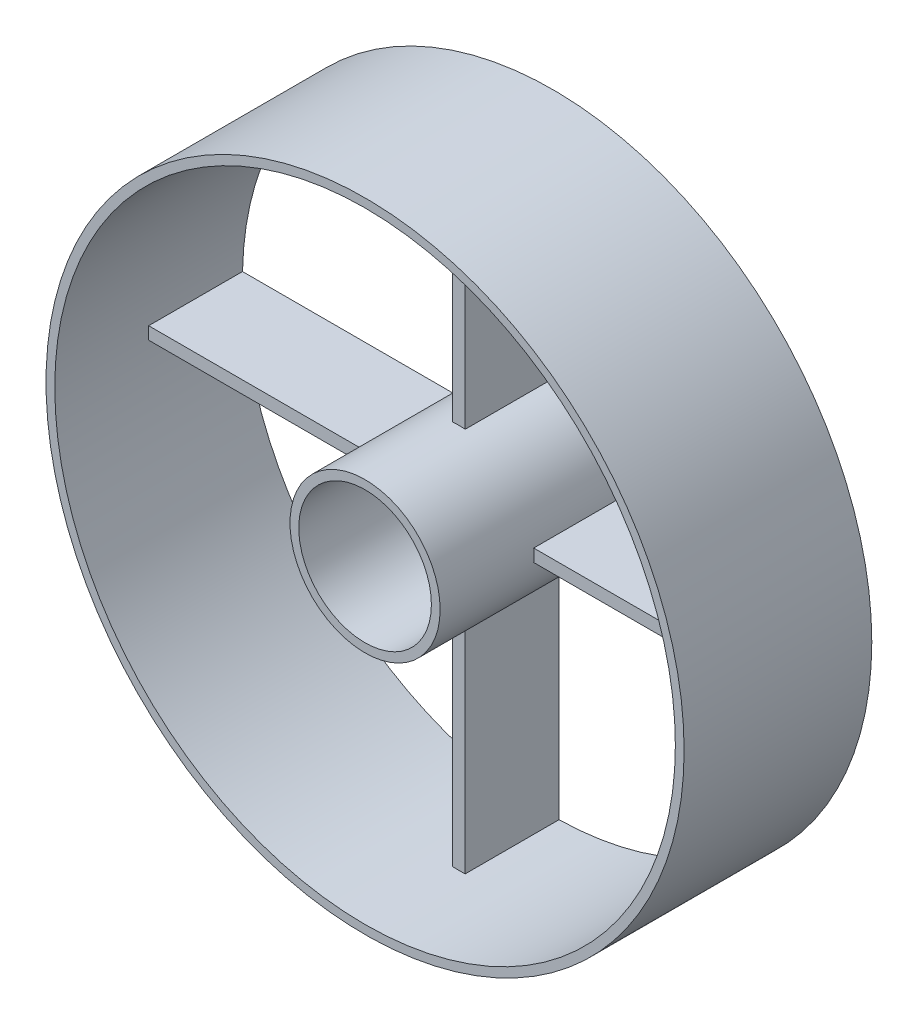
ISO-10303-21;
HEADER;
FILE_DESCRIPTION(('STEP AP214'),'2;1');
FILE_NAME('part.step','',(''),(''),'','','');
FILE_SCHEMA(('AUTOMOTIVE_DESIGN { 1 0 10303 214 1 1 1 1 }'));
ENDSEC;
DATA;
#1=APPLICATION_CONTEXT('core data for automotive mechanical design processes');
#2=APPLICATION_PROTOCOL_DEFINITION('international standard','automotive_design',2000,#1);
#3=PRODUCT_CONTEXT('',#1,'mechanical');
#4=PRODUCT('Part','Part','',(#3));
#5=PRODUCT_RELATED_PRODUCT_CATEGORY('part','',(#4));
#6=PRODUCT_DEFINITION_FORMATION('','',#4);
#7=PRODUCT_DEFINITION_CONTEXT('part definition',#1,'design');
#8=PRODUCT_DEFINITION('design','',#6,#7);
#9=PRODUCT_DEFINITION_SHAPE('','',#8);
#10=(LENGTH_UNIT() NAMED_UNIT(*) SI_UNIT(.MILLI.,.METRE.));
#11=(NAMED_UNIT(*) PLANE_ANGLE_UNIT() SI_UNIT($,.RADIAN.));
#12=(NAMED_UNIT(*) SI_UNIT($,.STERADIAN.) SOLID_ANGLE_UNIT());
#13=UNCERTAINTY_MEASURE_WITH_UNIT(LENGTH_MEASURE(1.E-05),#10,'distance_accuracy_value','');
#14=(GEOMETRIC_REPRESENTATION_CONTEXT(3) GLOBAL_UNCERTAINTY_ASSIGNED_CONTEXT((#13)) GLOBAL_UNIT_ASSIGNED_CONTEXT((#10,
#11,#12)) REPRESENTATION_CONTEXT('',''));
#15=CARTESIAN_POINT('',(0.,0.,0.));
#16=DIRECTION('',(0.,0.,1.));
#17=DIRECTION('',(1.,0.,0.));
#18=AXIS2_PLACEMENT_3D('',#15,#16,#17);
#19=CARTESIAN_POINT('',(0.,0.,-7.5));
#20=DIRECTION('',(0.,0.,1.));
#21=DIRECTION('',(1.,0.,0.));
#22=AXIS2_PLACEMENT_3D('',#19,#20,#21);
#23=CYLINDRICAL_SURFACE('',#22,25.5);
#24=CARTESIAN_POINT('',(0.,0.,-7.5));
#25=DIRECTION('',(0.,0.,1.));
#26=DIRECTION('',(1.,0.,0.));
#27=AXIS2_PLACEMENT_3D('',#24,#25,#26);
#28=CIRCLE('',#27,25.5);
#29=CARTESIAN_POINT('',(25.5,0.,-7.5));
#30=VERTEX_POINT('',#29);
#31=EDGE_CURVE('E12',#30,#30,#28,.T.);
#32=ORIENTED_EDGE('',*,*,#31,.T.);
#33=EDGE_LOOP('',(#32));
#34=FACE_BOUND('',#33,.T.);
#35=CARTESIAN_POINT('',(0.,0.,7.5));
#36=DIRECTION('',(0.,0.,1.));
#37=DIRECTION('',(1.,0.,0.));
#38=AXIS2_PLACEMENT_3D('',#35,#36,#37);
#39=CIRCLE('',#38,25.5);
#40=CARTESIAN_POINT('',(25.5,0.,7.5));
#41=VERTEX_POINT('',#40);
#42=EDGE_CURVE('E245',#41,#41,#39,.T.);
#43=ORIENTED_EDGE('',*,*,#42,.F.);
#44=EDGE_LOOP('',(#43));
#45=FACE_BOUND('',#44,.T.);
#46=ADVANCED_FACE('F102',(#34,#45),#23,.T.);
#47=CARTESIAN_POINT('',(0.,0.,-7.5));
#48=DIRECTION('',(0.,0.,1.));
#49=DIRECTION('',(1.,0.,0.));
#50=AXIS2_PLACEMENT_3D('',#47,#48,#49);
#51=PLANE('',#50);
#52=DIRECTION('',(0.,1.,0.));
#53=VECTOR('',#52,1.);
#54=CARTESIAN_POINT('',(0.500000000000003,-24.7949591651206,-7.5));
#55=LINE('',#54,#53);
#56=CARTESIAN_POINT('',(0.500000000000003,-24.7949591651206,-7.5));
#57=VERTEX_POINT('',#56);
#58=CARTESIAN_POINT('',(0.500000000000002,-5.9791303715507,-7.5));
#59=VERTEX_POINT('',#58);
#60=EDGE_CURVE('E218',#57,#59,#55,.T.);
#61=ORIENTED_EDGE('',*,*,#60,.F.);
#62=CARTESIAN_POINT('',(0.,0.,-7.5));
#63=DIRECTION('',(0.,0.,1.));
#64=DIRECTION('',(1.,0.,0.));
#65=AXIS2_PLACEMENT_3D('',#62,#63,#64);
#66=CIRCLE('',#65,24.8);
#67=CARTESIAN_POINT('',(24.7949591651206,-0.500000000000014,-7.5));
#68=VERTEX_POINT('',#67);
#69=EDGE_CURVE('E232',#57,#68,#66,.T.);
#70=ORIENTED_EDGE('',*,*,#69,.T.);
#71=DIRECTION('',(1.,0.,0.));
#72=VECTOR('',#71,1.);
#73=CARTESIAN_POINT('',(5.9791303715507,-0.5,-7.5));
#74=LINE('',#73,#72);
#75=CARTESIAN_POINT('',(5.9791303715507,-0.5,-7.5));
#76=VERTEX_POINT('',#75);
#77=EDGE_CURVE('E285',#76,#68,#74,.T.);
#78=ORIENTED_EDGE('',*,*,#77,.F.);
#79=CARTESIAN_POINT('',(0.,0.,-7.5));
#80=DIRECTION('',(0.,0.,1.));
#81=DIRECTION('',(1.,0.,0.));
#82=AXIS2_PLACEMENT_3D('',#79,#80,#81);
#83=CIRCLE('',#82,6.);
#84=EDGE_CURVE('E234',#59,#76,#83,.T.);
#85=ORIENTED_EDGE('',*,*,#84,.F.);
#86=EDGE_LOOP('',(#61,#70,#78,#85));
#87=FACE_BOUND('',#86,.T.);
#88=DIRECTION('',(1.,0.,0.));
#89=VECTOR('',#88,1.);
#90=CARTESIAN_POINT('',(-24.7949591651206,-0.5,-7.5));
#91=LINE('',#90,#89);
#92=CARTESIAN_POINT('',(-24.7949591651206,-0.5,-7.5));
#93=VERTEX_POINT('',#92);
#94=CARTESIAN_POINT('',(-5.9791303715507,-0.499999999999999,-7.5));
#95=VERTEX_POINT('',#94);
#96=EDGE_CURVE('E526',#93,#95,#91,.T.);
#97=ORIENTED_EDGE('',*,*,#96,.F.);
#98=CARTESIAN_POINT('',(-0.499999999999997,-24.7949591651206,-7.5));
#99=VERTEX_POINT('',#98);
#100=EDGE_CURVE('E242',#93,#99,#66,.T.);
#101=ORIENTED_EDGE('',*,*,#100,.T.);
#102=DIRECTION('',(0.,-1.,0.));
#103=VECTOR('',#102,1.);
#104=CARTESIAN_POINT('',(-0.499999999999997,-24.7949591651206,-7.5));
#105=LINE('',#104,#103);
#106=CARTESIAN_POINT('',(-0.499999999999997,-5.9791303715507,-7.5));
#107=VERTEX_POINT('',#106);
#108=EDGE_CURVE('E225',#107,#99,#105,.T.);
#109=ORIENTED_EDGE('',*,*,#108,.F.);
#110=EDGE_CURVE('E318',#95,#107,#83,.T.);
#111=ORIENTED_EDGE('',*,*,#110,.F.);
#112=EDGE_LOOP('',(#97,#101,#109,#111));
#113=FACE_BOUND('',#112,.T.);
#114=DIRECTION('',(-1.,0.,0.));
#115=VECTOR('',#114,1.);
#116=CARTESIAN_POINT('',(5.9791303715507,0.5,-7.5));
#117=LINE('',#116,#115);
#118=CARTESIAN_POINT('',(24.7949591651206,0.5,-7.5));
#119=VERTEX_POINT('',#118);
#120=CARTESIAN_POINT('',(5.9791303715507,0.5,-7.5));
#121=VERTEX_POINT('',#120);
#122=EDGE_CURVE('E287',#119,#121,#117,.T.);
#123=ORIENTED_EDGE('',*,*,#122,.F.);
#124=CARTESIAN_POINT('',(0.500000000000003,24.7949591651206,-7.5));
#125=VERTEX_POINT('',#124);
#126=EDGE_CURVE('E243',#119,#125,#66,.T.);
#127=ORIENTED_EDGE('',*,*,#126,.T.);
#128=DIRECTION('',(0.,1.,0.));
#129=VECTOR('',#128,1.);
#130=CARTESIAN_POINT('',(0.500000000000003,24.7949591651206,-7.5));
#131=LINE('',#130,#129);
#132=CARTESIAN_POINT('',(0.500000000000003,5.9791303715507,-7.5));
#133=VERTEX_POINT('',#132);
#134=EDGE_CURVE('E320',#133,#125,#131,.T.);
#135=ORIENTED_EDGE('',*,*,#134,.F.);
#136=EDGE_CURVE('E314',#121,#133,#83,.T.);
#137=ORIENTED_EDGE('',*,*,#136,.F.);
#138=EDGE_LOOP('',(#123,#127,#135,#137));
#139=FACE_BOUND('',#138,.T.);
#140=CARTESIAN_POINT('',(-0.499999999999997,24.7949591651206,-7.5));
#141=VERTEX_POINT('',#140);
#142=CARTESIAN_POINT('',(-24.7949591651206,0.5,-7.5));
#143=VERTEX_POINT('',#142);
#144=EDGE_CURVE('E109',#141,#143,#66,.T.);
#145=ORIENTED_EDGE('',*,*,#144,.T.);
#146=DIRECTION('',(-1.,0.,0.));
#147=VECTOR('',#146,1.);
#148=CARTESIAN_POINT('',(-24.7949591651206,0.5,-7.5));
#149=LINE('',#148,#147);
#150=CARTESIAN_POINT('',(-5.9791303715507,0.5,-7.5));
#151=VERTEX_POINT('',#150);
#152=EDGE_CURVE('E254',#151,#143,#149,.T.);
#153=ORIENTED_EDGE('',*,*,#152,.F.);
#154=CARTESIAN_POINT('',(-0.499999999999997,5.9791303715507,-7.5));
#155=VERTEX_POINT('',#154);
#156=EDGE_CURVE('E315',#155,#151,#83,.T.);
#157=ORIENTED_EDGE('',*,*,#156,.F.);
#158=DIRECTION('',(0.,-1.,0.));
#159=VECTOR('',#158,1.);
#160=CARTESIAN_POINT('',(-0.499999999999997,24.7949591651206,-7.5));
#161=LINE('',#160,#159);
#162=EDGE_CURVE('E256',#141,#155,#161,.T.);
#163=ORIENTED_EDGE('',*,*,#162,.F.);
#164=EDGE_LOOP('',(#145,#153,#157,#163));
#165=FACE_BOUND('',#164,.T.);
#166=ORIENTED_EDGE('',*,*,#31,.F.);
#167=EDGE_LOOP('',(#166));
#168=FACE_BOUND('',#167,.T.);
#169=CARTESIAN_POINT('',(0.,0.,-7.5));
#170=DIRECTION('',(0.,0.,1.));
#171=DIRECTION('',(1.,0.,0.));
#172=AXIS2_PLACEMENT_3D('',#169,#170,#171);
#173=CIRCLE('',#172,5.3);
#174=CARTESIAN_POINT('',(5.3,0.,-7.5));
#175=VERTEX_POINT('',#174);
#176=EDGE_CURVE('E311',#175,#175,#173,.T.);
#177=ORIENTED_EDGE('',*,*,#176,.T.);
#178=EDGE_LOOP('',(#177));
#179=FACE_BOUND('',#178,.T.);
#180=ADVANCED_FACE('F229',(#87,#113,#139,#165,#168,#179),#51,.F.);
#181=CARTESIAN_POINT('',(0.,0.,-7.5));
#182=DIRECTION('',(0.,0.,1.));
#183=DIRECTION('',(1.,0.,0.));
#184=AXIS2_PLACEMENT_3D('',#181,#182,#183);
#185=CYLINDRICAL_SURFACE('',#184,24.8);
#186=CARTESIAN_POINT('',(0.,0.,0.));
#187=DIRECTION('',(0.,0.,1.));
#188=DIRECTION('',(1.,0.,0.));
#189=AXIS2_PLACEMENT_3D('',#186,#187,#188);
#190=CIRCLE('',#189,24.8);
#191=CARTESIAN_POINT('',(-0.499999999999997,-24.7949591651206,0.));
#192=VERTEX_POINT('',#191);
#193=CARTESIAN_POINT('',(0.500000000000003,-24.7949591651206,0.));
#194=VERTEX_POINT('',#193);
#195=EDGE_CURVE('E513',#192,#194,#190,.T.);
#196=ORIENTED_EDGE('',*,*,#195,.F.);
#197=DIRECTION('',(0.,0.,1.));
#198=VECTOR('',#197,1.);
#199=CARTESIAN_POINT('',(-0.499999999999997,-24.7949591651206,-7.5));
#200=LINE('',#199,#198);
#201=EDGE_CURVE('E521',#99,#192,#200,.T.);
#202=ORIENTED_EDGE('',*,*,#201,.F.);
#203=ORIENTED_EDGE('',*,*,#100,.F.);
#204=DIRECTION('',(0.,0.,1.));
#205=VECTOR('',#204,1.);
#206=CARTESIAN_POINT('',(-24.7949591651206,-0.5,-7.5));
#207=LINE('',#206,#205);
#208=CARTESIAN_POINT('',(-24.7949591651206,-0.5,0.));
#209=VERTEX_POINT('',#208);
#210=EDGE_CURVE('E283',#93,#209,#207,.T.);
#211=ORIENTED_EDGE('',*,*,#210,.T.);
#212=CARTESIAN_POINT('',(0.,0.,0.));
#213=DIRECTION('',(0.,0.,1.));
#214=DIRECTION('',(1.,0.,0.));
#215=AXIS2_PLACEMENT_3D('',#212,#213,#214);
#216=CIRCLE('',#215,24.8);
#217=CARTESIAN_POINT('',(-24.7949591651206,0.5,0.));
#218=VERTEX_POINT('',#217);
#219=EDGE_CURVE('E266',#218,#209,#216,.T.);
#220=ORIENTED_EDGE('',*,*,#219,.F.);
#221=DIRECTION('',(0.,0.,1.));
#222=VECTOR('',#221,1.);
#223=CARTESIAN_POINT('',(-24.7949591651206,0.5,-7.5));
#224=LINE('',#223,#222);
#225=EDGE_CURVE('E263',#143,#218,#224,.T.);
#226=ORIENTED_EDGE('',*,*,#225,.F.);
#227=ORIENTED_EDGE('',*,*,#144,.F.);
#228=DIRECTION('',(0.,0.,1.));
#229=VECTOR('',#228,1.);
#230=CARTESIAN_POINT('',(-0.499999999999997,24.7949591651206,-7.5));
#231=LINE('',#230,#229);
#232=CARTESIAN_POINT('',(-0.499999999999997,24.7949591651206,0.));
#233=VERTEX_POINT('',#232);
#234=EDGE_CURVE('E260',#141,#233,#231,.T.);
#235=ORIENTED_EDGE('',*,*,#234,.T.);
#236=CARTESIAN_POINT('',(0.,0.,0.));
#237=DIRECTION('',(0.,0.,1.));
#238=DIRECTION('',(1.,0.,0.));
#239=AXIS2_PLACEMENT_3D('',#236,#237,#238);
#240=CIRCLE('',#239,24.8);
#241=CARTESIAN_POINT('',(0.500000000000003,24.7949591651206,0.));
#242=VERTEX_POINT('',#241);
#243=EDGE_CURVE('E317',#242,#233,#240,.T.);
#244=ORIENTED_EDGE('',*,*,#243,.F.);
#245=DIRECTION('',(0.,0.,1.));
#246=VECTOR('',#245,1.);
#247=CARTESIAN_POINT('',(0.500000000000003,24.7949591651206,-7.5));
#248=LINE('',#247,#246);
#249=EDGE_CURVE('E333',#125,#242,#248,.T.);
#250=ORIENTED_EDGE('',*,*,#249,.F.);
#251=ORIENTED_EDGE('',*,*,#126,.F.);
#252=DIRECTION('',(0.,0.,1.));
#253=VECTOR('',#252,1.);
#254=CARTESIAN_POINT('',(24.7949591651206,0.5,-7.5));
#255=LINE('',#254,#253);
#256=CARTESIAN_POINT('',(24.7949591651206,0.5,0.));
#257=VERTEX_POINT('',#256);
#258=EDGE_CURVE('E301',#119,#257,#255,.T.);
#259=ORIENTED_EDGE('',*,*,#258,.T.);
#260=CARTESIAN_POINT('',(0.,0.,0.));
#261=DIRECTION('',(0.,0.,1.));
#262=DIRECTION('',(1.,0.,0.));
#263=AXIS2_PLACEMENT_3D('',#260,#261,#262);
#264=CIRCLE('',#263,24.8);
#265=CARTESIAN_POINT('',(24.7949591651206,-0.5,0.));
#266=VERTEX_POINT('',#265);
#267=EDGE_CURVE('E293',#266,#257,#264,.T.);
#268=ORIENTED_EDGE('',*,*,#267,.F.);
#269=DIRECTION('',(0.,0.,1.));
#270=VECTOR('',#269,1.);
#271=CARTESIAN_POINT('',(24.7949591651206,-0.500000000000014,-7.5));
#272=LINE('',#271,#270);
#273=EDGE_CURVE('E241',#68,#266,#272,.T.);
#274=ORIENTED_EDGE('',*,*,#273,.F.);
#275=ORIENTED_EDGE('',*,*,#69,.F.);
#276=DIRECTION('',(0.,0.,1.));
#277=VECTOR('',#276,1.);
#278=CARTESIAN_POINT('',(0.500000000000003,-24.7949591651206,-7.5));
#279=LINE('',#278,#277);
#280=EDGE_CURVE('E215',#57,#194,#279,.T.);
#281=ORIENTED_EDGE('',*,*,#280,.T.);
#282=EDGE_LOOP('',(#196,#202,#203,#211,#220,#226,#227,#235,#244,#250,#251,#259,#268,#274,#275,#281));
#283=FACE_BOUND('',#282,.T.);
#284=CARTESIAN_POINT('',(0.,0.,7.5));
#285=DIRECTION('',(0.,0.,1.));
#286=DIRECTION('',(1.,0.,0.));
#287=AXIS2_PLACEMENT_3D('',#284,#285,#286);
#288=CIRCLE('',#287,24.8);
#289=CARTESIAN_POINT('',(24.8,0.,7.5));
#290=VERTEX_POINT('',#289);
#291=EDGE_CURVE('E336',#290,#290,#288,.T.);
#292=ORIENTED_EDGE('',*,*,#291,.T.);
#293=EDGE_LOOP('',(#292));
#294=FACE_BOUND('',#293,.T.);
#295=ADVANCED_FACE('F237',(#283,#294),#185,.F.);
#296=CARTESIAN_POINT('',(0.,0.,7.5));
#297=DIRECTION('',(0.,0.,1.));
#298=DIRECTION('',(1.,0.,0.));
#299=AXIS2_PLACEMENT_3D('',#296,#297,#298);
#300=PLANE('',#299);
#301=ORIENTED_EDGE('',*,*,#42,.T.);
#302=EDGE_LOOP('',(#301));
#303=FACE_BOUND('',#302,.T.);
#304=ORIENTED_EDGE('',*,*,#291,.F.);
#305=EDGE_LOOP('',(#304));
#306=FACE_BOUND('',#305,.T.);
#307=ADVANCED_FACE('F347',(#303,#306),#300,.T.);
#308=CARTESIAN_POINT('',(0.500000000000003,24.7949591651206,-7.5));
#309=DIRECTION('',(1.,0.,0.));
#310=DIRECTION('',(0.,0.,-1.));
#311=AXIS2_PLACEMENT_3D('',#308,#309,#310);
#312=PLANE('',#311);
#313=DIRECTION('',(0.,1.,0.));
#314=VECTOR('',#313,1.);
#315=CARTESIAN_POINT('',(0.500000000000003,24.7949591651206,0.));
#316=LINE('',#315,#314);
#317=CARTESIAN_POINT('',(0.500000000000003,5.9791303715507,0.));
#318=VERTEX_POINT('',#317);
#319=EDGE_CURVE('E321',#318,#242,#316,.T.);
#320=ORIENTED_EDGE('',*,*,#319,.F.);
#321=DIRECTION('',(0.,0.,1.));
#322=VECTOR('',#321,1.);
#323=CARTESIAN_POINT('',(0.500000000000003,5.9791303715507,-7.5));
#324=LINE('',#323,#322);
#325=EDGE_CURVE('E337',#133,#318,#324,.T.);
#326=ORIENTED_EDGE('',*,*,#325,.F.);
#327=ORIENTED_EDGE('',*,*,#134,.T.);
#328=ORIENTED_EDGE('',*,*,#249,.T.);
#329=EDGE_LOOP('',(#320,#326,#327,#328));
#330=FACE_BOUND('',#329,.T.);
#331=ADVANCED_FACE('F386',(#330),#312,.T.);
#332=CARTESIAN_POINT('',(-0.499999999999997,24.7949591651206,-7.5));
#333=DIRECTION('',(-1.,0.,0.));
#334=DIRECTION('',(0.,0.,1.));
#335=AXIS2_PLACEMENT_3D('',#332,#333,#334);
#336=PLANE('',#335);
#337=DIRECTION('',(0.,-1.,0.));
#338=VECTOR('',#337,1.);
#339=CARTESIAN_POINT('',(-0.499999999999997,24.7949591651206,0.));
#340=LINE('',#339,#338);
#341=CARTESIAN_POINT('',(-0.499999999999997,5.9791303715507,0.));
#342=VERTEX_POINT('',#341);
#343=EDGE_CURVE('E326',#233,#342,#340,.T.);
#344=ORIENTED_EDGE('',*,*,#343,.F.);
#345=ORIENTED_EDGE('',*,*,#234,.F.);
#346=ORIENTED_EDGE('',*,*,#162,.T.);
#347=DIRECTION('',(0.,0.,1.));
#348=VECTOR('',#347,1.);
#349=CARTESIAN_POINT('',(-0.499999999999997,5.9791303715507,-7.5));
#350=LINE('',#349,#348);
#351=EDGE_CURVE('E339',#155,#342,#350,.T.);
#352=ORIENTED_EDGE('',*,*,#351,.T.);
#353=EDGE_LOOP('',(#344,#345,#346,#352));
#354=FACE_BOUND('',#353,.T.);
#355=ADVANCED_FACE('F384',(#354),#336,.T.);
#356=CARTESIAN_POINT('',(0.,0.,0.));
#357=DIRECTION('',(0.,0.,1.));
#358=DIRECTION('',(1.,0.,0.));
#359=AXIS2_PLACEMENT_3D('',#356,#357,#358);
#360=PLANE('',#359);
#361=ORIENTED_EDGE('',*,*,#243,.T.);
#362=ORIENTED_EDGE('',*,*,#343,.T.);
#363=CARTESIAN_POINT('',(0.,0.,0.));
#364=DIRECTION('',(0.,0.,-1.));
#365=DIRECTION('',(1.,0.,0.));
#366=AXIS2_PLACEMENT_3D('',#363,#364,#365);
#367=CIRCLE('',#366,6.);
#368=EDGE_CURVE('E329',#342,#318,#367,.T.);
#369=ORIENTED_EDGE('',*,*,#368,.T.);
#370=ORIENTED_EDGE('',*,*,#319,.T.);
#371=EDGE_LOOP('',(#361,#362,#369,#370));
#372=FACE_BOUND('',#371,.T.);
#373=ADVANCED_FACE('F381',(#372),#360,.T.);
#374=CARTESIAN_POINT('',(0.,0.,-7.5));
#375=DIRECTION('',(0.,0.,1.));
#376=DIRECTION('',(1.,0.,0.));
#377=AXIS2_PLACEMENT_3D('',#374,#375,#376);
#378=CYLINDRICAL_SURFACE('',#377,6.);
#379=DIRECTION('',(0.,0.,1.));
#380=VECTOR('',#379,1.);
#381=CARTESIAN_POINT('',(-0.499999999999997,-5.9791303715507,-7.5));
#382=LINE('',#381,#380);
#383=CARTESIAN_POINT('',(-0.499999999999997,-5.9791303715507,0.));
#384=VERTEX_POINT('',#383);
#385=EDGE_CURVE('E523',#107,#384,#382,.T.);
#386=ORIENTED_EDGE('',*,*,#385,.T.);
#387=CARTESIAN_POINT('',(0.,0.,0.));
#388=DIRECTION('',(0.,0.,-1.));
#389=DIRECTION('',(1.,0.,0.));
#390=AXIS2_PLACEMENT_3D('',#387,#388,#389);
#391=CIRCLE('',#390,6.);
#392=CARTESIAN_POINT('',(0.500000000000003,-5.9791303715507,0.));
#393=VERTEX_POINT('',#392);
#394=EDGE_CURVE('E123',#393,#384,#391,.T.);
#395=ORIENTED_EDGE('',*,*,#394,.F.);
#396=DIRECTION('',(0.,0.,1.));
#397=VECTOR('',#396,1.);
#398=CARTESIAN_POINT('',(0.500000000000002,-5.9791303715507,-7.5));
#399=LINE('',#398,#397);
#400=EDGE_CURVE('E224',#59,#393,#399,.T.);
#401=ORIENTED_EDGE('',*,*,#400,.F.);
#402=ORIENTED_EDGE('',*,*,#84,.T.);
#403=DIRECTION('',(0.,0.,1.));
#404=VECTOR('',#403,1.);
#405=CARTESIAN_POINT('',(5.9791303715507,-0.5,-7.5));
#406=LINE('',#405,#404);
#407=CARTESIAN_POINT('',(5.9791303715507,-0.5,0.));
#408=VERTEX_POINT('',#407);
#409=EDGE_CURVE('E290',#76,#408,#406,.T.);
#410=ORIENTED_EDGE('',*,*,#409,.T.);
#411=CARTESIAN_POINT('',(0.,0.,0.));
#412=DIRECTION('',(0.,0.,-1.));
#413=DIRECTION('',(1.,0.,0.));
#414=AXIS2_PLACEMENT_3D('',#411,#412,#413);
#415=CIRCLE('',#414,6.);
#416=CARTESIAN_POINT('',(5.9791303715507,0.5,0.));
#417=VERTEX_POINT('',#416);
#418=EDGE_CURVE('E269',#417,#408,#415,.T.);
#419=ORIENTED_EDGE('',*,*,#418,.F.);
#420=DIRECTION('',(0.,0.,1.));
#421=VECTOR('',#420,1.);
#422=CARTESIAN_POINT('',(5.9791303715507,0.5,-7.5));
#423=LINE('',#422,#421);
#424=EDGE_CURVE('E297',#121,#417,#423,.T.);
#425=ORIENTED_EDGE('',*,*,#424,.F.);
#426=ORIENTED_EDGE('',*,*,#136,.T.);
#427=ORIENTED_EDGE('',*,*,#325,.T.);
#428=ORIENTED_EDGE('',*,*,#368,.F.);
#429=ORIENTED_EDGE('',*,*,#351,.F.);
#430=ORIENTED_EDGE('',*,*,#156,.T.);
#431=DIRECTION('',(0.,0.,1.));
#432=VECTOR('',#431,1.);
#433=CARTESIAN_POINT('',(-5.9791303715507,0.5,-7.5));
#434=LINE('',#433,#432);
#435=CARTESIAN_POINT('',(-5.9791303715507,0.5,0.));
#436=VERTEX_POINT('',#435);
#437=EDGE_CURVE('E270',#151,#436,#434,.T.);
#438=ORIENTED_EDGE('',*,*,#437,.T.);
#439=CARTESIAN_POINT('',(0.,0.,0.));
#440=DIRECTION('',(0.,0.,-1.));
#441=DIRECTION('',(1.,0.,0.));
#442=AXIS2_PLACEMENT_3D('',#439,#440,#441);
#443=CIRCLE('',#442,6.);
#444=CARTESIAN_POINT('',(-5.9791303715507,-0.5,0.));
#445=VERTEX_POINT('',#444);
#446=EDGE_CURVE('E533',#445,#436,#443,.T.);
#447=ORIENTED_EDGE('',*,*,#446,.F.);
#448=DIRECTION('',(0.,0.,1.));
#449=VECTOR('',#448,1.);
#450=CARTESIAN_POINT('',(-5.9791303715507,-0.499999999999999,-7.5));
#451=LINE('',#450,#449);
#452=EDGE_CURVE('E275',#95,#445,#451,.T.);
#453=ORIENTED_EDGE('',*,*,#452,.F.);
#454=ORIENTED_EDGE('',*,*,#110,.T.);
#455=EDGE_LOOP('',(#386,#395,#401,#402,#410,#419,#425,#426,#427,#428,#429,#430,#438,#447,#453,#454));
#456=FACE_BOUND('',#455,.T.);
#457=CARTESIAN_POINT('',(0.,0.,7.5));
#458=DIRECTION('',(0.,0.,1.));
#459=DIRECTION('',(1.,0.,0.));
#460=AXIS2_PLACEMENT_3D('',#457,#458,#459);
#461=CIRCLE('',#460,6.);
#462=CARTESIAN_POINT('',(6.,0.,7.5));
#463=VERTEX_POINT('',#462);
#464=EDGE_CURVE('E308',#463,#463,#461,.T.);
#465=ORIENTED_EDGE('',*,*,#464,.F.);
#466=EDGE_LOOP('',(#465));
#467=FACE_BOUND('',#466,.T.);
#468=ADVANCED_FACE('F363',(#456,#467),#378,.T.);
#469=CARTESIAN_POINT('',(0.,0.,-7.5));
#470=DIRECTION('',(0.,0.,1.));
#471=DIRECTION('',(1.,0.,0.));
#472=AXIS2_PLACEMENT_3D('',#469,#470,#471);
#473=CYLINDRICAL_SURFACE('',#472,5.3);
#474=ORIENTED_EDGE('',*,*,#176,.F.);
#475=EDGE_LOOP('',(#474));
#476=FACE_BOUND('',#475,.T.);
#477=CARTESIAN_POINT('',(0.,0.,7.5));
#478=DIRECTION('',(0.,0.,1.));
#479=DIRECTION('',(1.,0.,0.));
#480=AXIS2_PLACEMENT_3D('',#477,#478,#479);
#481=CIRCLE('',#480,5.3);
#482=CARTESIAN_POINT('',(5.3,0.,7.5));
#483=VERTEX_POINT('',#482);
#484=EDGE_CURVE('E300',#483,#483,#481,.T.);
#485=ORIENTED_EDGE('',*,*,#484,.T.);
#486=EDGE_LOOP('',(#485));
#487=FACE_BOUND('',#486,.T.);
#488=ADVANCED_FACE('F359',(#476,#487),#473,.F.);
#489=CARTESIAN_POINT('',(0.,0.,7.5));
#490=DIRECTION('',(0.,0.,1.));
#491=DIRECTION('',(1.,0.,0.));
#492=AXIS2_PLACEMENT_3D('',#489,#490,#491);
#493=PLANE('',#492);
#494=ORIENTED_EDGE('',*,*,#464,.T.);
#495=EDGE_LOOP('',(#494));
#496=FACE_BOUND('',#495,.T.);
#497=ORIENTED_EDGE('',*,*,#484,.F.);
#498=EDGE_LOOP('',(#497));
#499=FACE_BOUND('',#498,.T.);
#500=ADVANCED_FACE('F362',(#496,#499),#493,.T.);
#501=CARTESIAN_POINT('',(5.9791303715507,0.5,-7.5));
#502=DIRECTION('',(0.,1.,0.));
#503=DIRECTION('',(0.,0.,1.));
#504=AXIS2_PLACEMENT_3D('',#501,#502,#503);
#505=PLANE('',#504);
#506=DIRECTION('',(-1.,0.,0.));
#507=VECTOR('',#506,1.);
#508=CARTESIAN_POINT('',(5.9791303715507,0.5,0.));
#509=LINE('',#508,#507);
#510=EDGE_CURVE('E288',#257,#417,#509,.T.);
#511=ORIENTED_EDGE('',*,*,#510,.F.);
#512=ORIENTED_EDGE('',*,*,#258,.F.);
#513=ORIENTED_EDGE('',*,*,#122,.T.);
#514=ORIENTED_EDGE('',*,*,#424,.T.);
#515=EDGE_LOOP('',(#511,#512,#513,#514));
#516=FACE_BOUND('',#515,.T.);
#517=ADVANCED_FACE('F368',(#516),#505,.T.);
#518=CARTESIAN_POINT('',(5.9791303715507,-0.5,-7.5));
#519=DIRECTION('',(0.,-1.,0.));
#520=DIRECTION('',(0.,0.,-1.));
#521=AXIS2_PLACEMENT_3D('',#518,#519,#520);
#522=PLANE('',#521);
#523=DIRECTION('',(1.,0.,0.));
#524=VECTOR('',#523,1.);
#525=CARTESIAN_POINT('',(5.9791303715507,-0.5,0.));
#526=LINE('',#525,#524);
#527=EDGE_CURVE('E273',#408,#266,#526,.T.);
#528=ORIENTED_EDGE('',*,*,#527,.F.);
#529=ORIENTED_EDGE('',*,*,#409,.F.);
#530=ORIENTED_EDGE('',*,*,#77,.T.);
#531=ORIENTED_EDGE('',*,*,#273,.T.);
#532=EDGE_LOOP('',(#528,#529,#530,#531));
#533=FACE_BOUND('',#532,.T.);
#534=ADVANCED_FACE('F374',(#533),#522,.T.);
#535=CARTESIAN_POINT('',(0.,0.,0.));
#536=DIRECTION('',(0.,0.,1.));
#537=DIRECTION('',(1.,0.,0.));
#538=AXIS2_PLACEMENT_3D('',#535,#536,#537);
#539=PLANE('',#538);
#540=ORIENTED_EDGE('',*,*,#418,.T.);
#541=ORIENTED_EDGE('',*,*,#527,.T.);
#542=ORIENTED_EDGE('',*,*,#267,.T.);
#543=ORIENTED_EDGE('',*,*,#510,.T.);
#544=EDGE_LOOP('',(#540,#541,#542,#543));
#545=FACE_BOUND('',#544,.T.);
#546=ADVANCED_FACE('F444',(#545),#539,.T.);
#547=CARTESIAN_POINT('',(-24.7949591651206,0.5,-7.5));
#548=DIRECTION('',(0.,1.,0.));
#549=DIRECTION('',(0.,0.,1.));
#550=AXIS2_PLACEMENT_3D('',#547,#548,#549);
#551=PLANE('',#550);
#552=DIRECTION('',(-1.,0.,0.));
#553=VECTOR('',#552,1.);
#554=CARTESIAN_POINT('',(-24.7949591651206,0.5,0.));
#555=LINE('',#554,#553);
#556=EDGE_CURVE('E278',#436,#218,#555,.T.);
#557=ORIENTED_EDGE('',*,*,#556,.F.);
#558=ORIENTED_EDGE('',*,*,#437,.F.);
#559=ORIENTED_EDGE('',*,*,#152,.T.);
#560=ORIENTED_EDGE('',*,*,#225,.T.);
#561=EDGE_LOOP('',(#557,#558,#559,#560));
#562=FACE_BOUND('',#561,.T.);
#563=ADVANCED_FACE('F453',(#562),#551,.T.);
#564=CARTESIAN_POINT('',(-24.7949591651206,-0.5,-7.5));
#565=DIRECTION('',(0.,-1.,0.));
#566=DIRECTION('',(0.,0.,-1.));
#567=AXIS2_PLACEMENT_3D('',#564,#565,#566);
#568=PLANE('',#567);
#569=DIRECTION('',(1.,0.,0.));
#570=VECTOR('',#569,1.);
#571=CARTESIAN_POINT('',(-24.7949591651206,-0.5,0.));
#572=LINE('',#571,#570);
#573=EDGE_CURVE('E531',#209,#445,#572,.T.);
#574=ORIENTED_EDGE('',*,*,#573,.F.);
#575=ORIENTED_EDGE('',*,*,#210,.F.);
#576=ORIENTED_EDGE('',*,*,#96,.T.);
#577=ORIENTED_EDGE('',*,*,#452,.T.);
#578=EDGE_LOOP('',(#574,#575,#576,#577));
#579=FACE_BOUND('',#578,.T.);
#580=ADVANCED_FACE('F463',(#579),#568,.T.);
#581=CARTESIAN_POINT('',(0.,0.,0.));
#582=DIRECTION('',(0.,0.,1.));
#583=DIRECTION('',(1.,0.,0.));
#584=AXIS2_PLACEMENT_3D('',#581,#582,#583);
#585=PLANE('',#584);
#586=ORIENTED_EDGE('',*,*,#219,.T.);
#587=ORIENTED_EDGE('',*,*,#573,.T.);
#588=ORIENTED_EDGE('',*,*,#446,.T.);
#589=ORIENTED_EDGE('',*,*,#556,.T.);
#590=EDGE_LOOP('',(#586,#587,#588,#589));
#591=FACE_BOUND('',#590,.T.);
#592=ADVANCED_FACE('F472',(#591),#585,.T.);
#593=CARTESIAN_POINT('',(-0.499999999999997,-24.7949591651206,-7.5));
#594=DIRECTION('',(-1.,0.,0.));
#595=DIRECTION('',(0.,0.,1.));
#596=AXIS2_PLACEMENT_3D('',#593,#594,#595);
#597=PLANE('',#596);
#598=DIRECTION('',(0.,-1.,0.));
#599=VECTOR('',#598,1.);
#600=CARTESIAN_POINT('',(-0.499999999999997,-24.7949591651206,0.));
#601=LINE('',#600,#599);
#602=EDGE_CURVE('E116',#384,#192,#601,.T.);
#603=ORIENTED_EDGE('',*,*,#602,.F.);
#604=ORIENTED_EDGE('',*,*,#385,.F.);
#605=ORIENTED_EDGE('',*,*,#108,.T.);
#606=ORIENTED_EDGE('',*,*,#201,.T.);
#607=EDGE_LOOP('',(#603,#604,#605,#606));
#608=FACE_BOUND('',#607,.T.);
#609=ADVANCED_FACE('F482',(#608),#597,.T.);
#610=CARTESIAN_POINT('',(0.500000000000003,-24.7949591651206,-7.5));
#611=DIRECTION('',(1.,0.,0.));
#612=DIRECTION('',(0.,0.,-1.));
#613=AXIS2_PLACEMENT_3D('',#610,#611,#612);
#614=PLANE('',#613);
#615=DIRECTION('',(0.,1.,0.));
#616=VECTOR('',#615,1.);
#617=CARTESIAN_POINT('',(0.500000000000003,-24.7949591651206,0.));
#618=LINE('',#617,#616);
#619=EDGE_CURVE('E220',#194,#393,#618,.T.);
#620=ORIENTED_EDGE('',*,*,#619,.F.);
#621=ORIENTED_EDGE('',*,*,#280,.F.);
#622=ORIENTED_EDGE('',*,*,#60,.T.);
#623=ORIENTED_EDGE('',*,*,#400,.T.);
#624=EDGE_LOOP('',(#620,#621,#622,#623));
#625=FACE_BOUND('',#624,.T.);
#626=ADVANCED_FACE('F217',(#625),#614,.T.);
#627=CARTESIAN_POINT('',(0.,0.,0.));
#628=DIRECTION('',(0.,0.,1.));
#629=DIRECTION('',(1.,0.,0.));
#630=AXIS2_PLACEMENT_3D('',#627,#628,#629);
#631=PLANE('',#630);
#632=ORIENTED_EDGE('',*,*,#195,.T.);
#633=ORIENTED_EDGE('',*,*,#619,.T.);
#634=ORIENTED_EDGE('',*,*,#394,.T.);
#635=ORIENTED_EDGE('',*,*,#602,.T.);
#636=EDGE_LOOP('',(#632,#633,#634,#635));
#637=FACE_BOUND('',#636,.T.);
#638=ADVANCED_FACE('F501',(#637),#631,.T.);
#639=CLOSED_SHELL('',(#46,#180,#295,#307,#331,#355,#373,#468,#488,#500,#517,#534,#546,#563,#580,
#592,#609,#626,#638));
#640=MANIFOLD_SOLID_BREP('B2',#639);
#641=ADVANCED_BREP_SHAPE_REPRESENTATION('',(#18,#640),#14);
#642=SHAPE_DEFINITION_REPRESENTATION(#9,#641);
ENDSEC;
END-ISO-10303-21;
